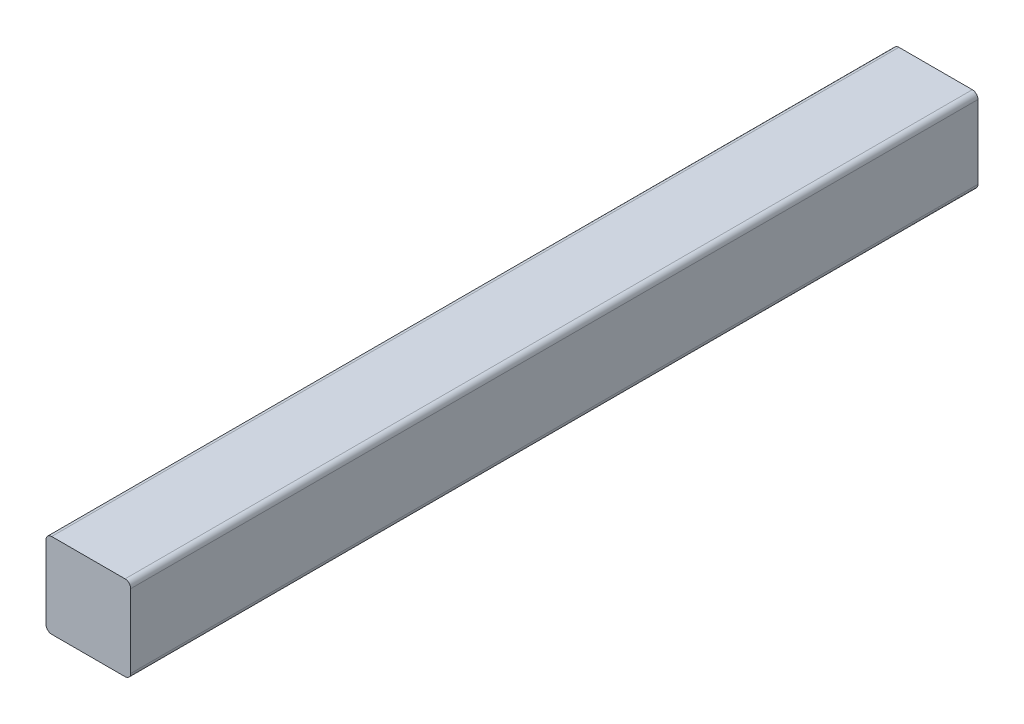
ISO-10303-21;
HEADER;
FILE_DESCRIPTION(('STEP AP214'),'2;1');
FILE_NAME('part.step','',(''),(''),'','','');
FILE_SCHEMA(('AUTOMOTIVE_DESIGN { 1 0 10303 214 1 1 1 1 }'));
ENDSEC;
DATA;
#1=APPLICATION_CONTEXT('core data for automotive mechanical design processes');
#2=APPLICATION_PROTOCOL_DEFINITION('international standard','automotive_design',2000,#1);
#3=PRODUCT_CONTEXT('',#1,'mechanical');
#4=PRODUCT('Part','Part','',(#3));
#5=PRODUCT_RELATED_PRODUCT_CATEGORY('part','',(#4));
#6=PRODUCT_DEFINITION_FORMATION('','',#4);
#7=PRODUCT_DEFINITION_CONTEXT('part definition',#1,'design');
#8=PRODUCT_DEFINITION('design','',#6,#7);
#9=PRODUCT_DEFINITION_SHAPE('','',#8);
#10=(LENGTH_UNIT() NAMED_UNIT(*) SI_UNIT(.MILLI.,.METRE.));
#11=(NAMED_UNIT(*) PLANE_ANGLE_UNIT() SI_UNIT($,.RADIAN.));
#12=(NAMED_UNIT(*) SI_UNIT($,.STERADIAN.) SOLID_ANGLE_UNIT());
#13=UNCERTAINTY_MEASURE_WITH_UNIT(LENGTH_MEASURE(1.E-05),#10,'distance_accuracy_value','');
#14=(GEOMETRIC_REPRESENTATION_CONTEXT(3) GLOBAL_UNCERTAINTY_ASSIGNED_CONTEXT((#13)) GLOBAL_UNIT_ASSIGNED_CONTEXT((#10,
#11,#12)) REPRESENTATION_CONTEXT('',''));
#15=CARTESIAN_POINT('',(0.,0.,0.));
#16=DIRECTION('',(0.,0.,1.));
#17=DIRECTION('',(1.,0.,0.));
#18=AXIS2_PLACEMENT_3D('',#15,#16,#17);
#19=CARTESIAN_POINT('',(2.,2.,300.));
#20=DIRECTION('',(0.,0.,-1.));
#21=DIRECTION('',(-1.,0.,0.));
#22=AXIS2_PLACEMENT_3D('',#19,#20,#21);
#23=CYLINDRICAL_SURFACE('',#22,2.);
#24=CARTESIAN_POINT('',(2.,2.,0.));
#25=DIRECTION('',(0.,0.,1.));
#26=DIRECTION('',(-1.,0.,0.));
#27=AXIS2_PLACEMENT_3D('',#24,#25,#26);
#28=CIRCLE('',#27,2.);
#29=CARTESIAN_POINT('',(0.,2.00000000000001,0.));
#30=VERTEX_POINT('',#29);
#31=CARTESIAN_POINT('',(2.00000000000001,0.,0.));
#32=VERTEX_POINT('',#31);
#33=EDGE_CURVE('E129',#30,#32,#28,.T.);
#34=ORIENTED_EDGE('',*,*,#33,.T.);
#35=DIRECTION('',(0.,0.,-1.));
#36=VECTOR('',#35,1.);
#37=CARTESIAN_POINT('',(2.00000000000001,0.,300.));
#38=LINE('',#37,#36);
#39=CARTESIAN_POINT('',(2.00000000000001,0.,300.));
#40=VERTEX_POINT('',#39);
#41=EDGE_CURVE('E11',#40,#32,#38,.T.);
#42=ORIENTED_EDGE('',*,*,#41,.F.);
#43=CARTESIAN_POINT('',(2.,2.,300.));
#44=DIRECTION('',(0.,0.,1.));
#45=DIRECTION('',(-1.,0.,0.));
#46=AXIS2_PLACEMENT_3D('',#43,#44,#45);
#47=CIRCLE('',#46,2.);
#48=CARTESIAN_POINT('',(0.,2.00000000000001,300.));
#49=VERTEX_POINT('',#48);
#50=EDGE_CURVE('E143',#49,#40,#47,.T.);
#51=ORIENTED_EDGE('',*,*,#50,.F.);
#52=DIRECTION('',(0.,0.,-1.));
#53=VECTOR('',#52,1.);
#54=CARTESIAN_POINT('',(0.,2.00000000000001,300.));
#55=LINE('',#54,#53);
#56=EDGE_CURVE('E125',#49,#30,#55,.T.);
#57=ORIENTED_EDGE('',*,*,#56,.T.);
#58=EDGE_LOOP('',(#34,#42,#51,#57));
#59=FACE_BOUND('',#58,.T.);
#60=ADVANCED_FACE('F33',(#59),#23,.T.);
#61=CARTESIAN_POINT('',(2.00000000000001,0.,300.));
#62=DIRECTION('',(0.,1.,0.));
#63=DIRECTION('',(0.,0.,1.));
#64=AXIS2_PLACEMENT_3D('',#61,#62,#63);
#65=PLANE('',#64);
#66=DIRECTION('',(1.,0.,0.));
#67=VECTOR('',#66,1.);
#68=CARTESIAN_POINT('',(2.00000000000001,0.,0.));
#69=LINE('',#68,#67);
#70=CARTESIAN_POINT('',(28.,0.,0.));
#71=VERTEX_POINT('',#70);
#72=EDGE_CURVE('E132',#32,#71,#69,.T.);
#73=ORIENTED_EDGE('',*,*,#72,.T.);
#74=DIRECTION('',(0.,0.,-1.));
#75=VECTOR('',#74,1.);
#76=CARTESIAN_POINT('',(28.,0.,300.));
#77=LINE('',#76,#75);
#78=CARTESIAN_POINT('',(28.,0.,300.));
#79=VERTEX_POINT('',#78);
#80=EDGE_CURVE('E41',#79,#71,#77,.T.);
#81=ORIENTED_EDGE('',*,*,#80,.F.);
#82=DIRECTION('',(1.,0.,0.));
#83=VECTOR('',#82,1.);
#84=CARTESIAN_POINT('',(2.00000000000001,0.,300.));
#85=LINE('',#84,#83);
#86=EDGE_CURVE('E92',#40,#79,#85,.T.);
#87=ORIENTED_EDGE('',*,*,#86,.F.);
#88=ORIENTED_EDGE('',*,*,#41,.T.);
#89=EDGE_LOOP('',(#73,#81,#87,#88));
#90=FACE_BOUND('',#89,.T.);
#91=ADVANCED_FACE('F178',(#90),#65,.F.);
#92=CARTESIAN_POINT('',(28.,2.,300.));
#93=DIRECTION('',(0.,0.,-1.));
#94=DIRECTION('',(-1.,0.,0.));
#95=AXIS2_PLACEMENT_3D('',#92,#93,#94);
#96=CYLINDRICAL_SURFACE('',#95,2.);
#97=CARTESIAN_POINT('',(28.,2.,0.));
#98=DIRECTION('',(0.,0.,1.));
#99=DIRECTION('',(-1.,0.,0.));
#100=AXIS2_PLACEMENT_3D('',#97,#98,#99);
#101=CIRCLE('',#100,2.);
#102=CARTESIAN_POINT('',(30.,2.00000000000001,0.));
#103=VERTEX_POINT('',#102);
#104=EDGE_CURVE('E134',#71,#103,#101,.T.);
#105=ORIENTED_EDGE('',*,*,#104,.T.);
#106=DIRECTION('',(0.,0.,-1.));
#107=VECTOR('',#106,1.);
#108=CARTESIAN_POINT('',(30.,2.00000000000001,300.));
#109=LINE('',#108,#107);
#110=CARTESIAN_POINT('',(30.,2.00000000000001,300.));
#111=VERTEX_POINT('',#110);
#112=EDGE_CURVE('E150',#111,#103,#109,.T.);
#113=ORIENTED_EDGE('',*,*,#112,.F.);
#114=CARTESIAN_POINT('',(28.,2.,300.));
#115=DIRECTION('',(0.,0.,1.));
#116=DIRECTION('',(-1.,0.,0.));
#117=AXIS2_PLACEMENT_3D('',#114,#115,#116);
#118=CIRCLE('',#117,2.);
#119=EDGE_CURVE('E158',#79,#111,#118,.T.);
#120=ORIENTED_EDGE('',*,*,#119,.F.);
#121=ORIENTED_EDGE('',*,*,#80,.T.);
#122=EDGE_LOOP('',(#105,#113,#120,#121));
#123=FACE_BOUND('',#122,.T.);
#124=ADVANCED_FACE('F156',(#123),#96,.T.);
#125=CARTESIAN_POINT('',(30.,2.00000000000001,300.));
#126=DIRECTION('',(-1.,0.,0.));
#127=DIRECTION('',(0.,0.,1.));
#128=AXIS2_PLACEMENT_3D('',#125,#126,#127);
#129=PLANE('',#128);
#130=DIRECTION('',(0.,1.,0.));
#131=VECTOR('',#130,1.);
#132=CARTESIAN_POINT('',(30.,2.00000000000001,0.));
#133=LINE('',#132,#131);
#134=CARTESIAN_POINT('',(30.,28.,0.));
#135=VERTEX_POINT('',#134);
#136=EDGE_CURVE('E136',#103,#135,#133,.T.);
#137=ORIENTED_EDGE('',*,*,#136,.T.);
#138=DIRECTION('',(0.,0.,-1.));
#139=VECTOR('',#138,1.);
#140=CARTESIAN_POINT('',(30.,28.,300.));
#141=LINE('',#140,#139);
#142=CARTESIAN_POINT('',(30.,28.,300.));
#143=VERTEX_POINT('',#142);
#144=EDGE_CURVE('E147',#143,#135,#141,.T.);
#145=ORIENTED_EDGE('',*,*,#144,.F.);
#146=DIRECTION('',(0.,1.,0.));
#147=VECTOR('',#146,1.);
#148=CARTESIAN_POINT('',(30.,2.00000000000001,300.));
#149=LINE('',#148,#147);
#150=EDGE_CURVE('E170',#111,#143,#149,.T.);
#151=ORIENTED_EDGE('',*,*,#150,.F.);
#152=ORIENTED_EDGE('',*,*,#112,.T.);
#153=EDGE_LOOP('',(#137,#145,#151,#152));
#154=FACE_BOUND('',#153,.T.);
#155=ADVANCED_FACE('F166',(#154),#129,.F.);
#156=CARTESIAN_POINT('',(28.,28.,300.));
#157=DIRECTION('',(0.,0.,-1.));
#158=DIRECTION('',(-1.,0.,0.));
#159=AXIS2_PLACEMENT_3D('',#156,#157,#158);
#160=CYLINDRICAL_SURFACE('',#159,2.);
#161=CARTESIAN_POINT('',(28.,28.,0.));
#162=DIRECTION('',(0.,0.,1.));
#163=DIRECTION('',(-1.,0.,0.));
#164=AXIS2_PLACEMENT_3D('',#161,#162,#163);
#165=CIRCLE('',#164,2.);
#166=CARTESIAN_POINT('',(28.,30.,0.));
#167=VERTEX_POINT('',#166);
#168=EDGE_CURVE('E138',#135,#167,#165,.T.);
#169=ORIENTED_EDGE('',*,*,#168,.T.);
#170=DIRECTION('',(0.,0.,-1.));
#171=VECTOR('',#170,1.);
#172=CARTESIAN_POINT('',(28.,30.,300.));
#173=LINE('',#172,#171);
#174=CARTESIAN_POINT('',(28.,30.,300.));
#175=VERTEX_POINT('',#174);
#176=EDGE_CURVE('E120',#175,#167,#173,.T.);
#177=ORIENTED_EDGE('',*,*,#176,.F.);
#178=CARTESIAN_POINT('',(28.,28.,300.));
#179=DIRECTION('',(0.,0.,1.));
#180=DIRECTION('',(-1.,0.,0.));
#181=AXIS2_PLACEMENT_3D('',#178,#179,#180);
#182=CIRCLE('',#181,2.);
#183=EDGE_CURVE('E111',#143,#175,#182,.T.);
#184=ORIENTED_EDGE('',*,*,#183,.F.);
#185=ORIENTED_EDGE('',*,*,#144,.T.);
#186=EDGE_LOOP('',(#169,#177,#184,#185));
#187=FACE_BOUND('',#186,.T.);
#188=ADVANCED_FACE('F169',(#187),#160,.T.);
#189=CARTESIAN_POINT('',(28.,30.,300.));
#190=DIRECTION('',(0.,-1.,0.));
#191=DIRECTION('',(0.,0.,-1.));
#192=AXIS2_PLACEMENT_3D('',#189,#190,#191);
#193=PLANE('',#192);
#194=DIRECTION('',(-1.,0.,0.));
#195=VECTOR('',#194,1.);
#196=CARTESIAN_POINT('',(28.,30.,0.));
#197=LINE('',#196,#195);
#198=CARTESIAN_POINT('',(2.00000000000001,30.,0.));
#199=VERTEX_POINT('',#198);
#200=EDGE_CURVE('E119',#167,#199,#197,.T.);
#201=ORIENTED_EDGE('',*,*,#200,.T.);
#202=DIRECTION('',(0.,0.,-1.));
#203=VECTOR('',#202,1.);
#204=CARTESIAN_POINT('',(2.00000000000001,30.,300.));
#205=LINE('',#204,#203);
#206=CARTESIAN_POINT('',(2.00000000000001,30.,300.));
#207=VERTEX_POINT('',#206);
#208=EDGE_CURVE('E116',#207,#199,#205,.T.);
#209=ORIENTED_EDGE('',*,*,#208,.F.);
#210=DIRECTION('',(-1.,0.,0.));
#211=VECTOR('',#210,1.);
#212=CARTESIAN_POINT('',(28.,30.,300.));
#213=LINE('',#212,#211);
#214=EDGE_CURVE('E105',#175,#207,#213,.T.);
#215=ORIENTED_EDGE('',*,*,#214,.F.);
#216=ORIENTED_EDGE('',*,*,#176,.T.);
#217=EDGE_LOOP('',(#201,#209,#215,#216));
#218=FACE_BOUND('',#217,.T.);
#219=ADVANCED_FACE('F117',(#218),#193,.F.);
#220=CARTESIAN_POINT('',(2.,28.,300.));
#221=DIRECTION('',(0.,0.,-1.));
#222=DIRECTION('',(-1.,0.,0.));
#223=AXIS2_PLACEMENT_3D('',#220,#221,#222);
#224=CYLINDRICAL_SURFACE('',#223,2.);
#225=CARTESIAN_POINT('',(2.,28.,0.));
#226=DIRECTION('',(0.,0.,1.));
#227=DIRECTION('',(-1.,0.,0.));
#228=AXIS2_PLACEMENT_3D('',#225,#226,#227);
#229=CIRCLE('',#228,2.);
#230=CARTESIAN_POINT('',(0.,28.,0.));
#231=VERTEX_POINT('',#230);
#232=EDGE_CURVE('E78',#199,#231,#229,.T.);
#233=ORIENTED_EDGE('',*,*,#232,.T.);
#234=DIRECTION('',(0.,0.,-1.));
#235=VECTOR('',#234,1.);
#236=CARTESIAN_POINT('',(0.,28.,300.));
#237=LINE('',#236,#235);
#238=CARTESIAN_POINT('',(0.,28.,300.));
#239=VERTEX_POINT('',#238);
#240=EDGE_CURVE('E121',#239,#231,#237,.T.);
#241=ORIENTED_EDGE('',*,*,#240,.F.);
#242=CARTESIAN_POINT('',(2.,28.,300.));
#243=DIRECTION('',(0.,0.,1.));
#244=DIRECTION('',(-1.,0.,0.));
#245=AXIS2_PLACEMENT_3D('',#242,#243,#244);
#246=CIRCLE('',#245,2.);
#247=EDGE_CURVE('E109',#207,#239,#246,.T.);
#248=ORIENTED_EDGE('',*,*,#247,.F.);
#249=ORIENTED_EDGE('',*,*,#208,.T.);
#250=EDGE_LOOP('',(#233,#241,#248,#249));
#251=FACE_BOUND('',#250,.T.);
#252=ADVANCED_FACE('F123',(#251),#224,.T.);
#253=CARTESIAN_POINT('',(0.,28.,300.));
#254=DIRECTION('',(1.,0.,0.));
#255=DIRECTION('',(0.,0.,-1.));
#256=AXIS2_PLACEMENT_3D('',#253,#254,#255);
#257=PLANE('',#256);
#258=DIRECTION('',(0.,-1.,0.));
#259=VECTOR('',#258,1.);
#260=CARTESIAN_POINT('',(0.,28.,0.));
#261=LINE('',#260,#259);
#262=EDGE_CURVE('E84',#231,#30,#261,.T.);
#263=ORIENTED_EDGE('',*,*,#262,.T.);
#264=ORIENTED_EDGE('',*,*,#56,.F.);
#265=DIRECTION('',(0.,-1.,0.));
#266=VECTOR('',#265,1.);
#267=CARTESIAN_POINT('',(0.,28.,300.));
#268=LINE('',#267,#266);
#269=EDGE_CURVE('E49',#239,#49,#268,.T.);
#270=ORIENTED_EDGE('',*,*,#269,.F.);
#271=ORIENTED_EDGE('',*,*,#240,.T.);
#272=EDGE_LOOP('',(#263,#264,#270,#271));
#273=FACE_BOUND('',#272,.T.);
#274=ADVANCED_FACE('F194',(#273),#257,.F.);
#275=CARTESIAN_POINT('',(2.,2.,300.));
#276=DIRECTION('',(0.,0.,-1.));
#277=DIRECTION('',(-1.,0.,0.));
#278=AXIS2_PLACEMENT_3D('',#275,#276,#277);
#279=PLANE('',#278);
#280=ORIENTED_EDGE('',*,*,#50,.T.);
#281=ORIENTED_EDGE('',*,*,#86,.T.);
#282=ORIENTED_EDGE('',*,*,#119,.T.);
#283=ORIENTED_EDGE('',*,*,#150,.T.);
#284=ORIENTED_EDGE('',*,*,#183,.T.);
#285=ORIENTED_EDGE('',*,*,#214,.T.);
#286=ORIENTED_EDGE('',*,*,#247,.T.);
#287=ORIENTED_EDGE('',*,*,#269,.T.);
#288=EDGE_LOOP('',(#280,#281,#282,#283,#284,#285,#286,#287));
#289=FACE_BOUND('',#288,.T.);
#290=ADVANCED_FACE('F107',(#289),#279,.F.);
#291=CARTESIAN_POINT('',(2.,2.,0.));
#292=DIRECTION('',(0.,0.,-1.));
#293=DIRECTION('',(-1.,0.,0.));
#294=AXIS2_PLACEMENT_3D('',#291,#292,#293);
#295=PLANE('',#294);
#296=ORIENTED_EDGE('',*,*,#33,.F.);
#297=ORIENTED_EDGE('',*,*,#262,.F.);
#298=ORIENTED_EDGE('',*,*,#232,.F.);
#299=ORIENTED_EDGE('',*,*,#200,.F.);
#300=ORIENTED_EDGE('',*,*,#168,.F.);
#301=ORIENTED_EDGE('',*,*,#136,.F.);
#302=ORIENTED_EDGE('',*,*,#104,.F.);
#303=ORIENTED_EDGE('',*,*,#72,.F.);
#304=EDGE_LOOP('',(#296,#297,#298,#299,#300,#301,#302,#303));
#305=FACE_BOUND('',#304,.T.);
#306=ADVANCED_FACE('F162',(#305),#295,.T.);
#307=CLOSED_SHELL('',(#60,#91,#124,#155,#188,#219,#252,#274,#290,#306));
#308=MANIFOLD_SOLID_BREP('B2',#307);
#309=ADVANCED_BREP_SHAPE_REPRESENTATION('',(#18,#308),#14);
#310=SHAPE_DEFINITION_REPRESENTATION(#9,#309);
ENDSEC;
END-ISO-10303-21;
